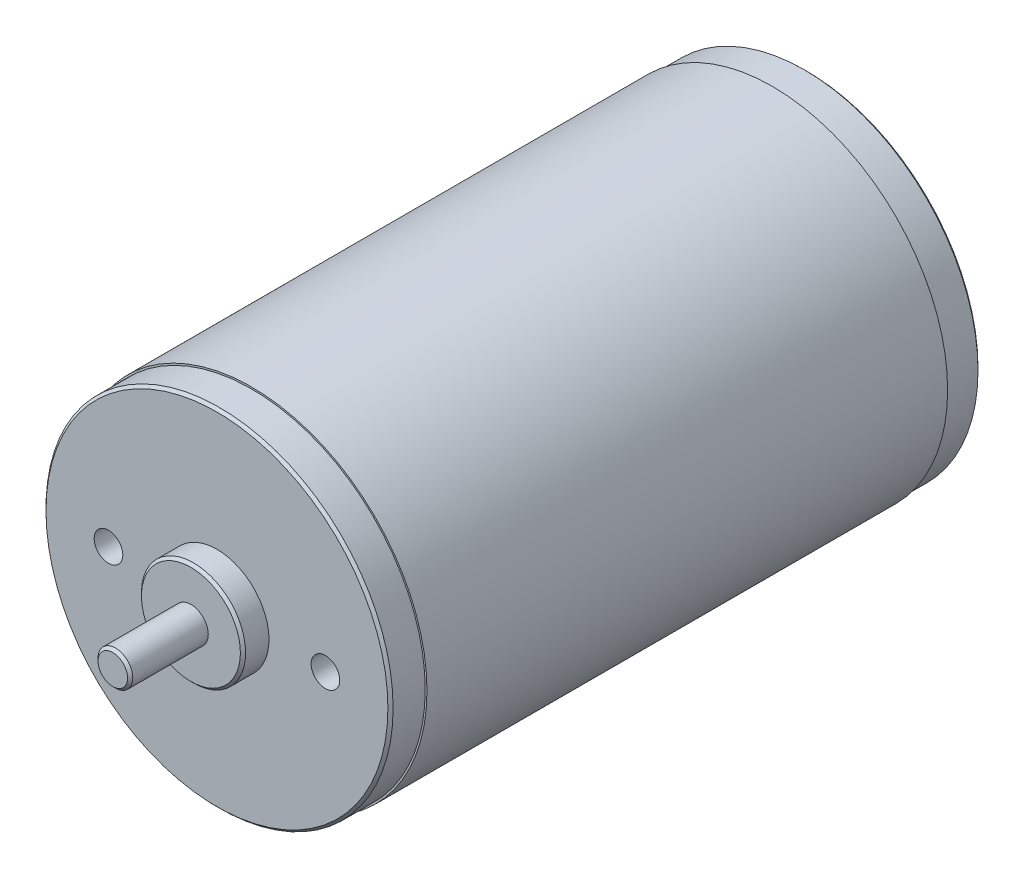
ISO-10303-21;
HEADER;
FILE_DESCRIPTION(('STEP AP214'),'2;1');
FILE_NAME('part.step','',(''),(''),'','','');
FILE_SCHEMA(('AUTOMOTIVE_DESIGN { 1 0 10303 214 1 1 1 1 }'));
ENDSEC;
DATA;
#1=APPLICATION_CONTEXT('core data for automotive mechanical design processes');
#2=APPLICATION_PROTOCOL_DEFINITION('international standard','automotive_design',2000,#1);
#3=PRODUCT_CONTEXT('',#1,'mechanical');
#4=PRODUCT('Part','Part','',(#3));
#5=PRODUCT_RELATED_PRODUCT_CATEGORY('part','',(#4));
#6=PRODUCT_DEFINITION_FORMATION('','',#4);
#7=PRODUCT_DEFINITION_CONTEXT('part definition',#1,'design');
#8=PRODUCT_DEFINITION('design','',#6,#7);
#9=PRODUCT_DEFINITION_SHAPE('','',#8);
#10=(LENGTH_UNIT() NAMED_UNIT(*) SI_UNIT(.MILLI.,.METRE.));
#11=(NAMED_UNIT(*) PLANE_ANGLE_UNIT() SI_UNIT($,.RADIAN.));
#12=(NAMED_UNIT(*) SI_UNIT($,.STERADIAN.) SOLID_ANGLE_UNIT());
#13=UNCERTAINTY_MEASURE_WITH_UNIT(LENGTH_MEASURE(1.E-05),#10,'distance_accuracy_value','');
#14=(GEOMETRIC_REPRESENTATION_CONTEXT(3) GLOBAL_UNCERTAINTY_ASSIGNED_CONTEXT((#13)) GLOBAL_UNIT_ASSIGNED_CONTEXT((#10,
#11,#12)) REPRESENTATION_CONTEXT('',''));
#15=CARTESIAN_POINT('',(0.,0.,0.));
#16=DIRECTION('',(0.,0.,1.));
#17=DIRECTION('',(1.,0.,0.));
#18=AXIS2_PLACEMENT_3D('',#15,#16,#17);
#19=CARTESIAN_POINT('',(0.,0.,-68.));
#20=DIRECTION('',(0.,0.,1.));
#21=DIRECTION('',(1.,0.,0.));
#22=AXIS2_PLACEMENT_3D('',#19,#20,#21);
#23=PLANE('',#22);
#24=CARTESIAN_POINT('',(0.,0.,-68.));
#25=DIRECTION('',(0.,0.,1.));
#26=DIRECTION('',(1.,0.,0.));
#27=AXIS2_PLACEMENT_3D('',#24,#25,#26);
#28=CIRCLE('',#27,19.7);
#29=CARTESIAN_POINT('',(19.7,0.,-68.));
#30=VERTEX_POINT('',#29);
#31=EDGE_CURVE('E88',#30,#30,#28,.F.);
#32=ORIENTED_EDGE('',*,*,#31,.T.);
#33=EDGE_LOOP('',(#32));
#34=FACE_BOUND('',#33,.T.);
#35=CARTESIAN_POINT('',(0.,0.,-68.));
#36=DIRECTION('',(0.,0.,1.));
#37=DIRECTION('',(1.,0.,0.));
#38=AXIS2_PLACEMENT_3D('',#35,#36,#37);
#39=CIRCLE('',#38,6.325);
#40=CARTESIAN_POINT('',(6.325,0.,-68.));
#41=VERTEX_POINT('',#40);
#42=EDGE_CURVE('E67',#41,#41,#39,.F.);
#43=ORIENTED_EDGE('',*,*,#42,.F.);
#44=EDGE_LOOP('',(#43));
#45=FACE_BOUND('',#44,.T.);
#46=ADVANCED_FACE('F14',(#34,#45),#23,.F.);
#47=CARTESIAN_POINT('',(0.,0.,-68.));
#48=DIRECTION('',(0.,0.,1.));
#49=DIRECTION('',(1.,0.,0.));
#50=AXIS2_PLACEMENT_3D('',#47,#48,#49);
#51=CYLINDRICAL_SURFACE('',#50,20.2);
#52=CARTESIAN_POINT('',(0.,0.,-4.));
#53=DIRECTION('',(0.,0.,1.));
#54=DIRECTION('',(1.,0.,0.));
#55=AXIS2_PLACEMENT_3D('',#52,#53,#54);
#56=CIRCLE('',#55,20.2);
#57=CARTESIAN_POINT('',(20.2,0.,-4.));
#58=VERTEX_POINT('',#57);
#59=EDGE_CURVE('E58',#58,#58,#56,.T.);
#60=ORIENTED_EDGE('',*,*,#59,.F.);
#61=EDGE_LOOP('',(#60));
#62=FACE_BOUND('',#61,.T.);
#63=CARTESIAN_POINT('',(0.,0.,-64.));
#64=DIRECTION('',(0.,0.,-1.));
#65=DIRECTION('',(-1.,0.,0.));
#66=AXIS2_PLACEMENT_3D('',#63,#64,#65);
#67=CIRCLE('',#66,20.2);
#68=CARTESIAN_POINT('',(-20.2,0.,-64.));
#69=VERTEX_POINT('',#68);
#70=EDGE_CURVE('E52',#69,#69,#67,.T.);
#71=ORIENTED_EDGE('',*,*,#70,.F.);
#72=EDGE_LOOP('',(#71));
#73=FACE_BOUND('',#72,.T.);
#74=ADVANCED_FACE('F111',(#62,#73),#51,.T.);
#75=CARTESIAN_POINT('',(0.,0.,0.));
#76=DIRECTION('',(0.,0.,1.));
#77=DIRECTION('',(1.,0.,0.));
#78=AXIS2_PLACEMENT_3D('',#75,#76,#77);
#79=PLANE('',#78);
#80=CARTESIAN_POINT('',(0.,0.,0.));
#81=DIRECTION('',(0.,0.,1.));
#82=DIRECTION('',(1.,0.,0.));
#83=AXIS2_PLACEMENT_3D('',#80,#81,#82);
#84=CIRCLE('',#83,19.7);
#85=CARTESIAN_POINT('',(19.7,0.,0.));
#86=VERTEX_POINT('',#85);
#87=EDGE_CURVE('E22',#86,#86,#84,.T.);
#88=ORIENTED_EDGE('',*,*,#87,.T.);
#89=EDGE_LOOP('',(#88));
#90=FACE_BOUND('',#89,.T.);
#91=CARTESIAN_POINT('',(-12.5,0.,0.));
#92=DIRECTION('',(0.,0.,1.));
#93=DIRECTION('',(1.,0.,0.));
#94=AXIS2_PLACEMENT_3D('',#91,#92,#93);
#95=CIRCLE('',#94,1.65);
#96=CARTESIAN_POINT('',(-10.85,0.,0.));
#97=VERTEX_POINT('',#96);
#98=EDGE_CURVE('E39',#97,#97,#95,.T.);
#99=ORIENTED_EDGE('',*,*,#98,.F.);
#100=EDGE_LOOP('',(#99));
#101=FACE_BOUND('',#100,.T.);
#102=CARTESIAN_POINT('',(12.5,0.,0.));
#103=DIRECTION('',(0.,0.,1.));
#104=DIRECTION('',(1.,0.,0.));
#105=AXIS2_PLACEMENT_3D('',#102,#103,#104);
#106=CIRCLE('',#105,1.65);
#107=CARTESIAN_POINT('',(14.15,0.,0.));
#108=VERTEX_POINT('',#107);
#109=EDGE_CURVE('E38',#108,#108,#106,.T.);
#110=ORIENTED_EDGE('',*,*,#109,.F.);
#111=EDGE_LOOP('',(#110));
#112=FACE_BOUND('',#111,.T.);
#113=CARTESIAN_POINT('',(0.,0.,0.));
#114=DIRECTION('',(0.,0.,1.));
#115=DIRECTION('',(1.,0.,0.));
#116=AXIS2_PLACEMENT_3D('',#113,#114,#115);
#117=CIRCLE('',#116,6.);
#118=CARTESIAN_POINT('',(6.,0.,0.));
#119=VERTEX_POINT('',#118);
#120=EDGE_CURVE('E61',#119,#119,#117,.T.);
#121=ORIENTED_EDGE('',*,*,#120,.F.);
#122=EDGE_LOOP('',(#121));
#123=FACE_BOUND('',#122,.T.);
#124=ADVANCED_FACE('F96',(#90,#101,#112,#123),#79,.T.);
#125=CARTESIAN_POINT('',(0.,0.,12.));
#126=DIRECTION('',(0.,0.,-1.));
#127=DIRECTION('',(-1.,0.,0.));
#128=AXIS2_PLACEMENT_3D('',#125,#126,#127);
#129=CYLINDRICAL_SURFACE('',#128,2.);
#130=CARTESIAN_POINT('',(0.,0.,11.7));
#131=DIRECTION('',(0.,0.,1.));
#132=DIRECTION('',(1.,0.,0.));
#133=AXIS2_PLACEMENT_3D('',#130,#131,#132);
#134=CIRCLE('',#133,2.);
#135=CARTESIAN_POINT('',(2.,0.,11.7));
#136=VERTEX_POINT('',#135);
#137=EDGE_CURVE('E73',#136,#136,#134,.F.);
#138=ORIENTED_EDGE('',*,*,#137,.T.);
#139=EDGE_LOOP('',(#138));
#140=FACE_BOUND('',#139,.T.);
#141=CARTESIAN_POINT('',(0.,0.,3.));
#142=DIRECTION('',(0.,0.,1.));
#143=DIRECTION('',(1.,0.,0.));
#144=AXIS2_PLACEMENT_3D('',#141,#142,#143);
#145=CIRCLE('',#144,2.);
#146=CARTESIAN_POINT('',(2.,0.,3.));
#147=VERTEX_POINT('',#146);
#148=EDGE_CURVE('E64',#147,#147,#145,.T.);
#149=ORIENTED_EDGE('',*,*,#148,.T.);
#150=EDGE_LOOP('',(#149));
#151=FACE_BOUND('',#150,.T.);
#152=ADVANCED_FACE('F127',(#140,#151),#129,.T.);
#153=CARTESIAN_POINT('',(0.,0.,12.));
#154=DIRECTION('',(0.,0.,1.));
#155=DIRECTION('',(1.,0.,0.));
#156=AXIS2_PLACEMENT_3D('',#153,#154,#155);
#157=PLANE('',#156);
#158=CARTESIAN_POINT('',(0.,0.,12.));
#159=DIRECTION('',(0.,0.,1.));
#160=DIRECTION('',(1.,0.,0.));
#161=AXIS2_PLACEMENT_3D('',#158,#159,#160);
#162=CIRCLE('',#161,1.7);
#163=CARTESIAN_POINT('',(1.7,0.,12.));
#164=VERTEX_POINT('',#163);
#165=EDGE_CURVE('E70',#164,#164,#162,.T.);
#166=ORIENTED_EDGE('',*,*,#165,.T.);
#167=EDGE_LOOP('',(#166));
#168=FACE_BOUND('',#167,.T.);
#169=ADVANCED_FACE('F133',(#168),#157,.T.);
#170=CARTESIAN_POINT('',(0.,0.,3.));
#171=DIRECTION('',(0.,0.,1.));
#172=DIRECTION('',(1.,0.,0.));
#173=AXIS2_PLACEMENT_3D('',#170,#171,#172);
#174=PLANE('',#173);
#175=CARTESIAN_POINT('',(0.,0.,3.));
#176=DIRECTION('',(0.,0.,1.));
#177=DIRECTION('',(1.,0.,0.));
#178=AXIS2_PLACEMENT_3D('',#175,#176,#177);
#179=CIRCLE('',#178,5.7);
#180=CARTESIAN_POINT('',(5.7,0.,3.));
#181=VERTEX_POINT('',#180);
#182=EDGE_CURVE('E76',#181,#181,#179,.T.);
#183=ORIENTED_EDGE('',*,*,#182,.T.);
#184=EDGE_LOOP('',(#183));
#185=FACE_BOUND('',#184,.T.);
#186=ORIENTED_EDGE('',*,*,#148,.F.);
#187=EDGE_LOOP('',(#186));
#188=FACE_BOUND('',#187,.T.);
#189=ADVANCED_FACE('F129',(#185,#188),#174,.T.);
#190=CARTESIAN_POINT('',(0.,0.,3.));
#191=DIRECTION('',(0.,0.,-1.));
#192=DIRECTION('',(-1.,0.,0.));
#193=AXIS2_PLACEMENT_3D('',#190,#191,#192);
#194=CYLINDRICAL_SURFACE('',#193,6.);
#195=CARTESIAN_POINT('',(0.,0.,2.7));
#196=DIRECTION('',(0.,0.,1.));
#197=DIRECTION('',(1.,0.,0.));
#198=AXIS2_PLACEMENT_3D('',#195,#196,#197);
#199=CIRCLE('',#198,6.);
#200=CARTESIAN_POINT('',(6.,0.,2.7));
#201=VERTEX_POINT('',#200);
#202=EDGE_CURVE('E79',#201,#201,#199,.F.);
#203=ORIENTED_EDGE('',*,*,#202,.T.);
#204=EDGE_LOOP('',(#203));
#205=FACE_BOUND('',#204,.T.);
#206=ORIENTED_EDGE('',*,*,#120,.T.);
#207=EDGE_LOOP('',(#206));
#208=FACE_BOUND('',#207,.T.);
#209=ADVANCED_FACE('F132',(#205,#208),#194,.T.);
#210=CARTESIAN_POINT('',(0.,0.,-4.));
#211=DIRECTION('',(0.,0.,1.));
#212=DIRECTION('',(1.,0.,0.));
#213=AXIS2_PLACEMENT_3D('',#210,#211,#212);
#214=PLANE('',#213);
#215=CARTESIAN_POINT('',(0.,0.,-4.));
#216=DIRECTION('',(0.,0.,1.));
#217=DIRECTION('',(1.,0.,0.));
#218=AXIS2_PLACEMENT_3D('',#215,#216,#217);
#219=CIRCLE('',#218,20.);
#220=CARTESIAN_POINT('',(20.,0.,-4.));
#221=VERTEX_POINT('',#220);
#222=EDGE_CURVE('E55',#221,#221,#219,.T.);
#223=ORIENTED_EDGE('',*,*,#222,.F.);
#224=EDGE_LOOP('',(#223));
#225=FACE_BOUND('',#224,.T.);
#226=ORIENTED_EDGE('',*,*,#59,.T.);
#227=EDGE_LOOP('',(#226));
#228=FACE_BOUND('',#227,.T.);
#229=ADVANCED_FACE('F124',(#225,#228),#214,.T.);
#230=CARTESIAN_POINT('',(0.,0.,-4.));
#231=DIRECTION('',(0.,0.,1.));
#232=DIRECTION('',(1.,0.,0.));
#233=AXIS2_PLACEMENT_3D('',#230,#231,#232);
#234=CYLINDRICAL_SURFACE('',#233,20.);
#235=CARTESIAN_POINT('',(0.,0.,-0.299999999999964));
#236=DIRECTION('',(0.,0.,1.));
#237=DIRECTION('',(1.,0.,0.));
#238=AXIS2_PLACEMENT_3D('',#235,#236,#237);
#239=CIRCLE('',#238,20.);
#240=CARTESIAN_POINT('',(20.,0.,-0.299999999999964));
#241=VERTEX_POINT('',#240);
#242=EDGE_CURVE('E9',#241,#241,#239,.F.);
#243=ORIENTED_EDGE('',*,*,#242,.T.);
#244=EDGE_LOOP('',(#243));
#245=FACE_BOUND('',#244,.T.);
#246=ORIENTED_EDGE('',*,*,#222,.T.);
#247=EDGE_LOOP('',(#246));
#248=FACE_BOUND('',#247,.T.);
#249=ADVANCED_FACE('F182',(#245,#248),#234,.T.);
#250=CARTESIAN_POINT('',(0.,0.,-64.));
#251=DIRECTION('',(0.,0.,-1.));
#252=DIRECTION('',(-1.,0.,0.));
#253=AXIS2_PLACEMENT_3D('',#250,#251,#252);
#254=PLANE('',#253);
#255=CARTESIAN_POINT('',(0.,0.,-64.));
#256=DIRECTION('',(0.,0.,-1.));
#257=DIRECTION('',(-1.,0.,0.));
#258=AXIS2_PLACEMENT_3D('',#255,#256,#257);
#259=CIRCLE('',#258,20.);
#260=CARTESIAN_POINT('',(-20.,0.,-64.));
#261=VERTEX_POINT('',#260);
#262=EDGE_CURVE('E49',#261,#261,#259,.T.);
#263=ORIENTED_EDGE('',*,*,#262,.F.);
#264=EDGE_LOOP('',(#263));
#265=FACE_BOUND('',#264,.T.);
#266=ORIENTED_EDGE('',*,*,#70,.T.);
#267=EDGE_LOOP('',(#266));
#268=FACE_BOUND('',#267,.T.);
#269=ADVANCED_FACE('F179',(#265,#268),#254,.T.);
#270=CARTESIAN_POINT('',(0.,0.,-64.));
#271=DIRECTION('',(0.,0.,-1.));
#272=DIRECTION('',(-1.,0.,0.));
#273=AXIS2_PLACEMENT_3D('',#270,#271,#272);
#274=CYLINDRICAL_SURFACE('',#273,20.);
#275=CARTESIAN_POINT('',(0.,0.,-67.7));
#276=DIRECTION('',(0.,0.,1.));
#277=DIRECTION('',(1.,0.,0.));
#278=AXIS2_PLACEMENT_3D('',#275,#276,#277);
#279=CIRCLE('',#278,20.);
#280=CARTESIAN_POINT('',(20.,0.,-67.7));
#281=VERTEX_POINT('',#280);
#282=EDGE_CURVE('E91',#281,#281,#279,.T.);
#283=ORIENTED_EDGE('',*,*,#282,.T.);
#284=EDGE_LOOP('',(#283));
#285=FACE_BOUND('',#284,.T.);
#286=ORIENTED_EDGE('',*,*,#262,.T.);
#287=EDGE_LOOP('',(#286));
#288=FACE_BOUND('',#287,.T.);
#289=ADVANCED_FACE('F172',(#285,#288),#274,.T.);
#290=CARTESIAN_POINT('',(0.,0.,-69.5));
#291=DIRECTION('',(0.,0.,1.));
#292=DIRECTION('',(1.,0.,0.));
#293=AXIS2_PLACEMENT_3D('',#290,#291,#292);
#294=CYLINDRICAL_SURFACE('',#293,6.325);
#295=CARTESIAN_POINT('',(0.,0.,-69.2));
#296=DIRECTION('',(0.,0.,-1.));
#297=DIRECTION('',(-1.,0.,0.));
#298=AXIS2_PLACEMENT_3D('',#295,#296,#297);
#299=CIRCLE('',#298,6.325);
#300=CARTESIAN_POINT('',(-6.325,0.,-69.2));
#301=VERTEX_POINT('',#300);
#302=EDGE_CURVE('E85',#301,#301,#299,.F.);
#303=ORIENTED_EDGE('',*,*,#302,.T.);
#304=EDGE_LOOP('',(#303));
#305=FACE_BOUND('',#304,.T.);
#306=ORIENTED_EDGE('',*,*,#42,.T.);
#307=EDGE_LOOP('',(#306));
#308=FACE_BOUND('',#307,.T.);
#309=ADVANCED_FACE('F164',(#305,#308),#294,.T.);
#310=CARTESIAN_POINT('',(0.,0.,-69.5));
#311=DIRECTION('',(0.,0.,-1.));
#312=DIRECTION('',(-1.,0.,0.));
#313=AXIS2_PLACEMENT_3D('',#310,#311,#312);
#314=PLANE('',#313);
#315=CARTESIAN_POINT('',(0.,0.,-69.5));
#316=DIRECTION('',(0.,0.,-1.));
#317=DIRECTION('',(-1.,0.,0.));
#318=AXIS2_PLACEMENT_3D('',#315,#316,#317);
#319=CIRCLE('',#318,6.025);
#320=CARTESIAN_POINT('',(-6.025,0.,-69.5));
#321=VERTEX_POINT('',#320);
#322=EDGE_CURVE('E82',#321,#321,#319,.T.);
#323=ORIENTED_EDGE('',*,*,#322,.T.);
#324=EDGE_LOOP('',(#323));
#325=FACE_BOUND('',#324,.T.);
#326=ADVANCED_FACE('F161',(#325),#314,.T.);
#327=CARTESIAN_POINT('',(12.5,0.,-8.1));
#328=DIRECTION('',(0.,0.,1.));
#329=DIRECTION('',(1.,0.,0.));
#330=AXIS2_PLACEMENT_3D('',#327,#328,#329);
#331=CONICAL_SURFACE('',#330,1.65,1.02974425867665);
#332=CARTESIAN_POINT('',(12.5,0.,-9.09142002139548));
#333=VERTEX_POINT('',#332);
#334=VERTEX_LOOP('',#333);
#335=FACE_BOUND('',#334,.T.);
#336=CARTESIAN_POINT('',(12.5,0.,-8.1));
#337=DIRECTION('',(0.,0.,1.));
#338=DIRECTION('',(1.,0.,0.));
#339=AXIS2_PLACEMENT_3D('',#336,#337,#338);
#340=CIRCLE('',#339,1.65);
#341=CARTESIAN_POINT('',(14.15,0.,-8.1));
#342=VERTEX_POINT('',#341);
#343=EDGE_CURVE('E42',#342,#342,#340,.T.);
#344=ORIENTED_EDGE('',*,*,#343,.T.);
#345=EDGE_LOOP('',(#344));
#346=FACE_BOUND('',#345,.T.);
#347=ADVANCED_FACE('F163',(#335,#346),#331,.F.);
#348=CARTESIAN_POINT('',(12.5,0.,0.));
#349=DIRECTION('',(0.,0.,1.));
#350=DIRECTION('',(1.,0.,0.));
#351=AXIS2_PLACEMENT_3D('',#348,#349,#350);
#352=CYLINDRICAL_SURFACE('',#351,1.65);
#353=ORIENTED_EDGE('',*,*,#343,.F.);
#354=EDGE_LOOP('',(#353));
#355=FACE_BOUND('',#354,.T.);
#356=ORIENTED_EDGE('',*,*,#109,.T.);
#357=EDGE_LOOP('',(#356));
#358=FACE_BOUND('',#357,.T.);
#359=ADVANCED_FACE('F32',(#355,#358),#352,.F.);
#360=CARTESIAN_POINT('',(-12.5,0.,-8.1));
#361=DIRECTION('',(0.,0.,1.));
#362=DIRECTION('',(1.,0.,0.));
#363=AXIS2_PLACEMENT_3D('',#360,#361,#362);
#364=CONICAL_SURFACE('',#363,1.65,1.02974425867665);
#365=CARTESIAN_POINT('',(-12.5,0.,-9.09142002139548));
#366=VERTEX_POINT('',#365);
#367=VERTEX_LOOP('',#366);
#368=FACE_BOUND('',#367,.T.);
#369=CARTESIAN_POINT('',(-12.5,0.,-8.1));
#370=DIRECTION('',(0.,0.,1.));
#371=DIRECTION('',(1.,0.,0.));
#372=AXIS2_PLACEMENT_3D('',#369,#370,#371);
#373=CIRCLE('',#372,1.65);
#374=CARTESIAN_POINT('',(-10.85,0.,-8.1));
#375=VERTEX_POINT('',#374);
#376=EDGE_CURVE('E36',#375,#375,#373,.T.);
#377=ORIENTED_EDGE('',*,*,#376,.T.);
#378=EDGE_LOOP('',(#377));
#379=FACE_BOUND('',#378,.T.);
#380=ADVANCED_FACE('F28',(#368,#379),#364,.F.);
#381=CARTESIAN_POINT('',(-12.5,0.,0.));
#382=DIRECTION('',(0.,0.,1.));
#383=DIRECTION('',(1.,0.,0.));
#384=AXIS2_PLACEMENT_3D('',#381,#382,#383);
#385=CYLINDRICAL_SURFACE('',#384,1.65);
#386=ORIENTED_EDGE('',*,*,#376,.F.);
#387=EDGE_LOOP('',(#386));
#388=FACE_BOUND('',#387,.T.);
#389=ORIENTED_EDGE('',*,*,#98,.T.);
#390=EDGE_LOOP('',(#389));
#391=FACE_BOUND('',#390,.T.);
#392=ADVANCED_FACE('F31',(#388,#391),#385,.F.);
#393=CARTESIAN_POINT('',(0.,0.,12.));
#394=DIRECTION('',(0.,0.,-1.));
#395=DIRECTION('',(-1.,0.,0.));
#396=AXIS2_PLACEMENT_3D('',#393,#394,#395);
#397=CONICAL_SURFACE('',#396,1.7,0.785398163397439);
#398=ORIENTED_EDGE('',*,*,#137,.F.);
#399=EDGE_LOOP('',(#398));
#400=FACE_BOUND('',#399,.T.);
#401=ORIENTED_EDGE('',*,*,#165,.F.);
#402=EDGE_LOOP('',(#401));
#403=FACE_BOUND('',#402,.T.);
#404=ADVANCED_FACE('F144',(#400,#403),#397,.T.);
#405=CARTESIAN_POINT('',(0.,0.,3.));
#406=DIRECTION('',(0.,0.,-1.));
#407=DIRECTION('',(-1.,0.,0.));
#408=AXIS2_PLACEMENT_3D('',#405,#406,#407);
#409=CONICAL_SURFACE('',#408,5.7,0.785398163397448);
#410=ORIENTED_EDGE('',*,*,#202,.F.);
#411=EDGE_LOOP('',(#410));
#412=FACE_BOUND('',#411,.T.);
#413=ORIENTED_EDGE('',*,*,#182,.F.);
#414=EDGE_LOOP('',(#413));
#415=FACE_BOUND('',#414,.T.);
#416=ADVANCED_FACE('F147',(#412,#415),#409,.T.);
#417=CARTESIAN_POINT('',(0.,0.,-69.5));
#418=DIRECTION('',(0.,0.,1.));
#419=DIRECTION('',(1.,0.,0.));
#420=AXIS2_PLACEMENT_3D('',#417,#418,#419);
#421=CONICAL_SURFACE('',#420,6.025,0.785398163397429);
#422=ORIENTED_EDGE('',*,*,#302,.F.);
#423=EDGE_LOOP('',(#422));
#424=FACE_BOUND('',#423,.T.);
#425=ORIENTED_EDGE('',*,*,#322,.F.);
#426=EDGE_LOOP('',(#425));
#427=FACE_BOUND('',#426,.T.);
#428=ADVANCED_FACE('F107',(#424,#427),#421,.T.);
#429=CARTESIAN_POINT('',(0.,0.,-68.));
#430=DIRECTION('',(0.,0.,1.));
#431=DIRECTION('',(1.,0.,0.));
#432=AXIS2_PLACEMENT_3D('',#429,#430,#431);
#433=CONICAL_SURFACE('',#432,19.7,0.785398163397466);
#434=ORIENTED_EDGE('',*,*,#282,.F.);
#435=EDGE_LOOP('',(#434));
#436=FACE_BOUND('',#435,.T.);
#437=ORIENTED_EDGE('',*,*,#31,.F.);
#438=EDGE_LOOP('',(#437));
#439=FACE_BOUND('',#438,.T.);
#440=ADVANCED_FACE('F100',(#436,#439),#433,.T.);
#441=CARTESIAN_POINT('',(0.,0.,0.));
#442=DIRECTION('',(0.,0.,-1.));
#443=DIRECTION('',(-1.,0.,0.));
#444=AXIS2_PLACEMENT_3D('',#441,#442,#443);
#445=CONICAL_SURFACE('',#444,19.7,0.785398163397472);
#446=ORIENTED_EDGE('',*,*,#242,.F.);
#447=EDGE_LOOP('',(#446));
#448=FACE_BOUND('',#447,.T.);
#449=ORIENTED_EDGE('',*,*,#87,.F.);
#450=EDGE_LOOP('',(#449));
#451=FACE_BOUND('',#450,.T.);
#452=ADVANCED_FACE('F16',(#448,#451),#445,.T.);
#453=CLOSED_SHELL('',(#46,#74,#124,#152,#169,#189,#209,#229,#249,#269,#289,#309,#326,#347,#359,
#380,#392,#404,#416,#428,#440,#452));
#454=MANIFOLD_SOLID_BREP('B1',#453);
#455=ADVANCED_BREP_SHAPE_REPRESENTATION('',(#18,#454),#14);
#456=SHAPE_DEFINITION_REPRESENTATION(#9,#455);
ENDSEC;
END-ISO-10303-21;
